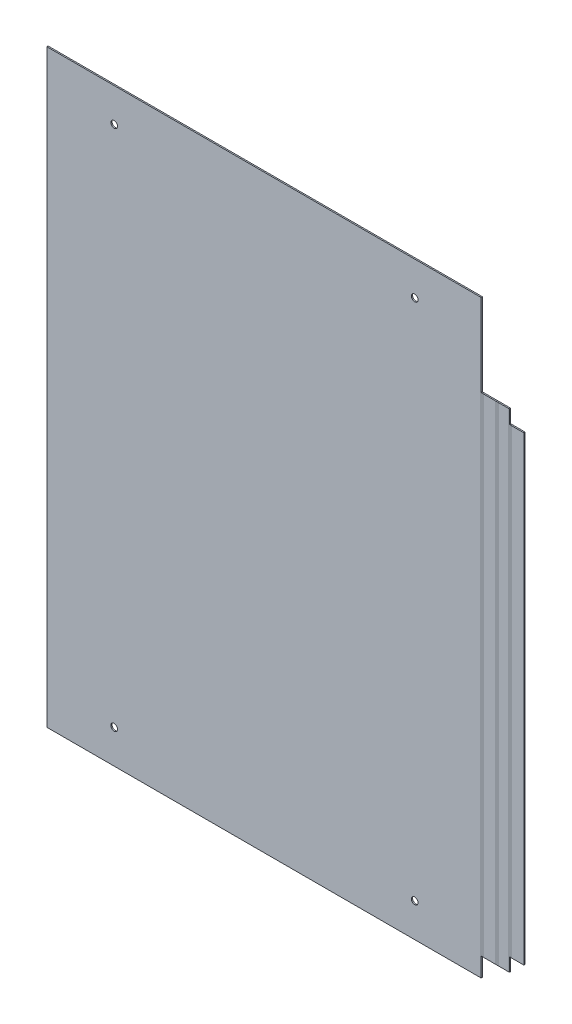
ISO-10303-21;
HEADER;
FILE_DESCRIPTION(('STEP AP214'),'2;1');
FILE_NAME('part.step','',(''),(''),'','','');
FILE_SCHEMA(('AUTOMOTIVE_DESIGN { 1 0 10303 214 1 1 1 1 }'));
ENDSEC;
DATA;
#1=APPLICATION_CONTEXT('core data for automotive mechanical design processes');
#2=APPLICATION_PROTOCOL_DEFINITION('international standard','automotive_design',2000,#1);
#3=PRODUCT_CONTEXT('',#1,'mechanical');
#4=PRODUCT('Part','Part','',(#3));
#5=PRODUCT_RELATED_PRODUCT_CATEGORY('part','',(#4));
#6=PRODUCT_DEFINITION_FORMATION('','',#4);
#7=PRODUCT_DEFINITION_CONTEXT('part definition',#1,'design');
#8=PRODUCT_DEFINITION('design','',#6,#7);
#9=PRODUCT_DEFINITION_SHAPE('','',#8);
#10=(LENGTH_UNIT() NAMED_UNIT(*) SI_UNIT(.MILLI.,.METRE.));
#11=(NAMED_UNIT(*) PLANE_ANGLE_UNIT() SI_UNIT($,.RADIAN.));
#12=(NAMED_UNIT(*) SI_UNIT($,.STERADIAN.) SOLID_ANGLE_UNIT());
#13=UNCERTAINTY_MEASURE_WITH_UNIT(LENGTH_MEASURE(1.E-05),#10,'distance_accuracy_value','');
#14=(GEOMETRIC_REPRESENTATION_CONTEXT(3) GLOBAL_UNCERTAINTY_ASSIGNED_CONTEXT((#13)) GLOBAL_UNIT_ASSIGNED_CONTEXT((#10,
#11,#12)) REPRESENTATION_CONTEXT('',''));
#15=CARTESIAN_POINT('',(0.,0.,0.));
#16=DIRECTION('',(0.,0.,1.));
#17=DIRECTION('',(1.,0.,0.));
#18=AXIS2_PLACEMENT_3D('',#15,#16,#17);
#19=CARTESIAN_POINT('',(343.802210169545,876.2,0.));
#20=DIRECTION('',(0.,0.,-1.));
#21=DIRECTION('',(-1.,0.,0.));
#22=AXIS2_PLACEMENT_3D('',#19,#20,#21);
#23=PLANE('',#22);
#24=DIRECTION('',(0.,-1.,0.));
#25=VECTOR('',#24,1.);
#26=CARTESIAN_POINT('',(346.438810169545,876.2,0.));
#27=LINE('',#26,#25);
#28=CARTESIAN_POINT('',(346.438810169545,753.7,0.));
#29=VERTEX_POINT('',#28);
#30=CARTESIAN_POINT('',(346.438810169545,28.4000000000006,0.));
#31=VERTEX_POINT('',#30);
#32=EDGE_CURVE('E430',#29,#31,#27,.T.);
#33=ORIENTED_EDGE('',*,*,#32,.F.);
#34=DIRECTION('',(-1.,0.,0.));
#35=VECTOR('',#34,1.);
#36=CARTESIAN_POINT('',(354.752210169545,753.7,0.));
#37=LINE('',#36,#35);
#38=CARTESIAN_POINT('',(363.065610169545,753.7,0.));
#39=VERTEX_POINT('',#38);
#40=EDGE_CURVE('E312',#39,#29,#37,.T.);
#41=ORIENTED_EDGE('',*,*,#40,.F.);
#42=DIRECTION('',(0.,-1.,0.));
#43=VECTOR('',#42,1.);
#44=CARTESIAN_POINT('',(363.065610169545,876.2,0.));
#45=LINE('',#44,#43);
#46=CARTESIAN_POINT('',(363.065610169545,28.4,0.));
#47=VERTEX_POINT('',#46);
#48=EDGE_CURVE('E440',#39,#47,#45,.T.);
#49=ORIENTED_EDGE('',*,*,#48,.T.);
#50=DIRECTION('',(-1.,0.,0.));
#51=VECTOR('',#50,1.);
#52=CARTESIAN_POINT('',(343.802210169545,28.4,0.));
#53=LINE('',#52,#51);
#54=EDGE_CURVE('E427',#47,#31,#53,.T.);
#55=ORIENTED_EDGE('',*,*,#54,.T.);
#56=EDGE_LOOP('',(#33,#41,#49,#55));
#57=FACE_BOUND('',#56,.T.);
#58=ADVANCED_FACE('F69',(#57),#23,.T.);
#59=CARTESIAN_POINT('',(343.802210169545,876.2,1.90000000000001));
#60=DIRECTION('',(0.,0.,-1.));
#61=DIRECTION('',(-1.,0.,0.));
#62=AXIS2_PLACEMENT_3D('',#59,#60,#61);
#63=PLANE('',#62);
#64=DIRECTION('',(-1.,0.,0.));
#65=VECTOR('',#64,1.);
#66=CARTESIAN_POINT('',(343.802210169545,753.7,1.90000000000001));
#67=LINE('',#66,#65);
#68=CARTESIAN_POINT('',(363.065610169545,753.7,1.90000000000001));
#69=VERTEX_POINT('',#68);
#70=CARTESIAN_POINT('',(346.438810169545,753.7,1.90000000000001));
#71=VERTEX_POINT('',#70);
#72=EDGE_CURVE('E91',#69,#71,#67,.T.);
#73=ORIENTED_EDGE('',*,*,#72,.T.);
#74=DIRECTION('',(0.,-1.,0.));
#75=VECTOR('',#74,1.);
#76=CARTESIAN_POINT('',(346.438810169545,876.2,1.90000000000001));
#77=LINE('',#76,#75);
#78=CARTESIAN_POINT('',(346.438810169545,28.4000000000004,1.90000000000001));
#79=VERTEX_POINT('',#78);
#80=EDGE_CURVE('E436',#71,#79,#77,.T.);
#81=ORIENTED_EDGE('',*,*,#80,.T.);
#82=DIRECTION('',(1.,0.,0.));
#83=VECTOR('',#82,1.);
#84=CARTESIAN_POINT('',(354.752210169545,28.4,1.90000000000001));
#85=LINE('',#84,#83);
#86=CARTESIAN_POINT('',(363.065610169545,28.4,1.90000000000001));
#87=VERTEX_POINT('',#86);
#88=EDGE_CURVE('E83',#87,#79,#85,.F.);
#89=ORIENTED_EDGE('',*,*,#88,.F.);
#90=DIRECTION('',(0.,-1.,0.));
#91=VECTOR('',#90,1.);
#92=CARTESIAN_POINT('',(363.065610169545,876.2,1.90000000000001));
#93=LINE('',#92,#91);
#94=EDGE_CURVE('E76',#69,#87,#93,.T.);
#95=ORIENTED_EDGE('',*,*,#94,.F.);
#96=EDGE_LOOP('',(#73,#81,#89,#95));
#97=FACE_BOUND('',#96,.T.);
#98=ADVANCED_FACE('F451',(#97),#63,.F.);
#99=CARTESIAN_POINT('',(343.802210169545,753.7,1.90000000000001));
#100=DIRECTION('',(0.,-1.,0.));
#101=DIRECTION('',(-1.,0.,0.));
#102=AXIS2_PLACEMENT_3D('',#99,#100,#101);
#103=PLANE('',#102);
#104=ORIENTED_EDGE('',*,*,#40,.T.);
#105=DIRECTION('',(0.,0.,1.));
#106=VECTOR('',#105,1.);
#107=CARTESIAN_POINT('',(346.438810169545,753.7,0.));
#108=LINE('',#107,#106);
#109=EDGE_CURVE('E438',#29,#71,#108,.T.);
#110=ORIENTED_EDGE('',*,*,#109,.T.);
#111=ORIENTED_EDGE('',*,*,#72,.F.);
#112=DIRECTION('',(0.,0.,1.));
#113=VECTOR('',#112,1.);
#114=CARTESIAN_POINT('',(363.065610169545,753.7,0.));
#115=LINE('',#114,#113);
#116=EDGE_CURVE('E442',#39,#69,#115,.T.);
#117=ORIENTED_EDGE('',*,*,#116,.F.);
#118=EDGE_LOOP('',(#104,#110,#111,#117));
#119=FACE_BOUND('',#118,.T.);
#120=ADVANCED_FACE('F456',(#119),#103,.F.);
#121=CARTESIAN_POINT('',(343.802210169545,28.4,0.));
#122=DIRECTION('',(0.,1.,0.));
#123=DIRECTION('',(-1.,0.,0.));
#124=AXIS2_PLACEMENT_3D('',#121,#122,#123);
#125=PLANE('',#124);
#126=DIRECTION('',(0.,0.,-1.));
#127=VECTOR('',#126,1.);
#128=CARTESIAN_POINT('',(363.065610169545,28.4000000000002,1.90000000000001));
#129=LINE('',#128,#127);
#130=EDGE_CURVE('E12',#87,#47,#129,.T.);
#131=ORIENTED_EDGE('',*,*,#130,.F.);
#132=ORIENTED_EDGE('',*,*,#88,.T.);
#133=DIRECTION('',(0.,-3.01445295852608E-13,-1.));
#134=VECTOR('',#133,1.);
#135=CARTESIAN_POINT('',(346.438810169545,28.4,1.90000000000007));
#136=LINE('',#135,#134);
#137=EDGE_CURVE('E434',#79,#31,#136,.T.);
#138=ORIENTED_EDGE('',*,*,#137,.T.);
#139=ORIENTED_EDGE('',*,*,#54,.F.);
#140=EDGE_LOOP('',(#131,#132,#138,#139));
#141=FACE_BOUND('',#140,.T.);
#142=ADVANCED_FACE('F531',(#141),#125,.F.);
#143=CARTESIAN_POINT('',(304.7866,876.2,25.7366));
#144=DIRECTION('',(0.,-1.,0.));
#145=DIRECTION('',(-1.,0.,0.));
#146=AXIS2_PLACEMENT_3D('',#143,#144,#145);
#147=PLANE('',#146);
#148=DIRECTION('',(1.,0.,0.));
#149=VECTOR('',#148,1.);
#150=CARTESIAN_POINT('',(-324.05,876.2,1.9));
#151=LINE('',#150,#149);
#152=CARTESIAN_POINT('',(-324.05,876.2,1.9));
#153=VERTEX_POINT('',#152);
#154=CARTESIAN_POINT('',(321.4134,876.2,1.9));
#155=VERTEX_POINT('',#154);
#156=EDGE_CURVE('E414',#153,#155,#151,.T.);
#157=ORIENTED_EDGE('',*,*,#156,.T.);
#158=DIRECTION('',(0.,0.,-1.));
#159=VECTOR('',#158,1.);
#160=CARTESIAN_POINT('',(321.4134,876.2,1.9));
#161=LINE('',#160,#159);
#162=CARTESIAN_POINT('',(321.4134,876.2,0.));
#163=VERTEX_POINT('',#162);
#164=EDGE_CURVE('E411',#155,#163,#161,.T.);
#165=ORIENTED_EDGE('',*,*,#164,.T.);
#166=DIRECTION('',(1.,0.,0.));
#167=VECTOR('',#166,1.);
#168=CARTESIAN_POINT('',(-324.05,876.2,0.));
#169=LINE('',#168,#167);
#170=CARTESIAN_POINT('',(-324.05,876.2,0.));
#171=VERTEX_POINT('',#170);
#172=EDGE_CURVE('E358',#171,#163,#169,.T.);
#173=ORIENTED_EDGE('',*,*,#172,.F.);
#174=DIRECTION('',(0.,0.,-1.));
#175=VECTOR('',#174,1.);
#176=CARTESIAN_POINT('',(-324.05,876.2,1.9));
#177=LINE('',#176,#175);
#178=EDGE_CURVE('E408',#153,#171,#177,.T.);
#179=ORIENTED_EDGE('',*,*,#178,.F.);
#180=EDGE_LOOP('',(#157,#165,#173,#179));
#181=FACE_BOUND('',#180,.T.);
#182=ADVANCED_FACE('F535',(#181),#147,.F.);
#183=CARTESIAN_POINT('',(-324.05,876.2,1.9));
#184=DIRECTION('',(-1.,0.,0.));
#185=DIRECTION('',(0.,0.,1.));
#186=AXIS2_PLACEMENT_3D('',#183,#184,#185);
#187=PLANE('',#186);
#188=DIRECTION('',(0.,0.,-1.));
#189=VECTOR('',#188,1.);
#190=CARTESIAN_POINT('',(-324.05,0.,1.9));
#191=LINE('',#190,#189);
#192=CARTESIAN_POINT('',(-324.05,0.,1.9));
#193=VERTEX_POINT('',#192);
#194=CARTESIAN_POINT('',(-324.05,0.,0.));
#195=VERTEX_POINT('',#194);
#196=EDGE_CURVE('E397',#193,#195,#191,.T.);
#197=ORIENTED_EDGE('',*,*,#196,.F.);
#198=DIRECTION('',(0.,-1.,0.));
#199=VECTOR('',#198,1.);
#200=CARTESIAN_POINT('',(-324.05,876.2,1.9));
#201=LINE('',#200,#199);
#202=EDGE_CURVE('E375',#153,#193,#201,.T.);
#203=ORIENTED_EDGE('',*,*,#202,.F.);
#204=ORIENTED_EDGE('',*,*,#178,.T.);
#205=DIRECTION('',(0.,-1.,0.));
#206=VECTOR('',#205,1.);
#207=CARTESIAN_POINT('',(-324.05,876.2,0.));
#208=LINE('',#207,#206);
#209=EDGE_CURVE('E406',#171,#195,#208,.T.);
#210=ORIENTED_EDGE('',*,*,#209,.T.);
#211=EDGE_LOOP('',(#197,#203,#204,#210));
#212=FACE_BOUND('',#211,.T.);
#213=ADVANCED_FACE('F941',(#212),#187,.T.);
#214=CARTESIAN_POINT('',(322.15,0.,2.6366));
#215=DIRECTION('',(0.,-1.,0.));
#216=DIRECTION('',(0.,0.,-1.));
#217=AXIS2_PLACEMENT_3D('',#214,#215,#216);
#218=PLANE('',#217);
#219=DIRECTION('',(1.,0.,0.));
#220=VECTOR('',#219,1.);
#221=CARTESIAN_POINT('',(-324.05,0.,0.));
#222=LINE('',#221,#220);
#223=CARTESIAN_POINT('',(321.4134,0.,0.));
#224=VERTEX_POINT('',#223);
#225=EDGE_CURVE('E403',#195,#224,#222,.T.);
#226=ORIENTED_EDGE('',*,*,#225,.T.);
#227=DIRECTION('',(0.,0.,1.));
#228=VECTOR('',#227,1.);
#229=CARTESIAN_POINT('',(321.4134,0.,0.));
#230=LINE('',#229,#228);
#231=CARTESIAN_POINT('',(321.4134,0.,1.9));
#232=VERTEX_POINT('',#231);
#233=EDGE_CURVE('E400',#224,#232,#230,.T.);
#234=ORIENTED_EDGE('',*,*,#233,.T.);
#235=DIRECTION('',(1.,0.,0.));
#236=VECTOR('',#235,1.);
#237=CARTESIAN_POINT('',(-324.05,0.,1.9));
#238=LINE('',#237,#236);
#239=EDGE_CURVE('E377',#193,#232,#238,.T.);
#240=ORIENTED_EDGE('',*,*,#239,.F.);
#241=ORIENTED_EDGE('',*,*,#196,.T.);
#242=EDGE_LOOP('',(#226,#234,#240,#241));
#243=FACE_BOUND('',#242,.T.);
#244=ADVANCED_FACE('F929',(#243),#218,.T.);
#245=CARTESIAN_POINT('',(-224.05,826.2,0.));
#246=DIRECTION('',(0.,0.,1.));
#247=DIRECTION('',(1.,0.,0.));
#248=AXIS2_PLACEMENT_3D('',#245,#246,#247);
#249=CYLINDRICAL_SURFACE('',#248,4.99999999999999);
#250=CARTESIAN_POINT('',(-224.05,826.2,0.));
#251=DIRECTION('',(0.,0.,1.));
#252=DIRECTION('',(1.,0.,0.));
#253=AXIS2_PLACEMENT_3D('',#250,#251,#252);
#254=CIRCLE('',#253,4.99999999999999);
#255=CARTESIAN_POINT('',(-219.05,826.2,0.));
#256=VERTEX_POINT('',#255);
#257=EDGE_CURVE('E361',#256,#256,#254,.T.);
#258=ORIENTED_EDGE('',*,*,#257,.F.);
#259=EDGE_LOOP('',(#258));
#260=FACE_BOUND('',#259,.T.);
#261=CARTESIAN_POINT('',(-224.05,826.2,1.9));
#262=DIRECTION('',(0.,0.,-1.));
#263=DIRECTION('',(-1.,0.,0.));
#264=AXIS2_PLACEMENT_3D('',#261,#262,#263);
#265=CIRCLE('',#264,4.99999999999999);
#266=CARTESIAN_POINT('',(-229.05,826.2,1.9));
#267=VERTEX_POINT('',#266);
#268=EDGE_CURVE('E380',#267,#267,#265,.T.);
#269=ORIENTED_EDGE('',*,*,#268,.F.);
#270=EDGE_LOOP('',(#269));
#271=FACE_BOUND('',#270,.T.);
#272=ADVANCED_FACE('F917',(#260,#271),#249,.F.);
#273=CARTESIAN_POINT('',(222.7317,826.2,0.));
#274=DIRECTION('',(0.,0.,1.));
#275=DIRECTION('',(1.,0.,0.));
#276=AXIS2_PLACEMENT_3D('',#273,#274,#275);
#277=CYLINDRICAL_SURFACE('',#276,5.00000000000002);
#278=CARTESIAN_POINT('',(222.7317,826.2,0.));
#279=DIRECTION('',(0.,0.,1.));
#280=DIRECTION('',(1.,0.,0.));
#281=AXIS2_PLACEMENT_3D('',#278,#279,#280);
#282=CIRCLE('',#281,5.00000000000002);
#283=CARTESIAN_POINT('',(227.7317,826.2,0.));
#284=VERTEX_POINT('',#283);
#285=EDGE_CURVE('E364',#284,#284,#282,.T.);
#286=ORIENTED_EDGE('',*,*,#285,.F.);
#287=EDGE_LOOP('',(#286));
#288=FACE_BOUND('',#287,.T.);
#289=CARTESIAN_POINT('',(222.7317,826.2,1.9));
#290=DIRECTION('',(0.,0.,-1.));
#291=DIRECTION('',(-1.,0.,0.));
#292=AXIS2_PLACEMENT_3D('',#289,#290,#291);
#293=CIRCLE('',#292,5.00000000000002);
#294=CARTESIAN_POINT('',(217.7317,826.2,1.9));
#295=VERTEX_POINT('',#294);
#296=EDGE_CURVE('E383',#295,#295,#293,.T.);
#297=ORIENTED_EDGE('',*,*,#296,.F.);
#298=EDGE_LOOP('',(#297));
#299=FACE_BOUND('',#298,.T.);
#300=ADVANCED_FACE('F905',(#288,#299),#277,.F.);
#301=CARTESIAN_POINT('',(222.7317,50.,0.));
#302=DIRECTION('',(0.,0.,1.));
#303=DIRECTION('',(1.,0.,0.));
#304=AXIS2_PLACEMENT_3D('',#301,#302,#303);
#305=CYLINDRICAL_SURFACE('',#304,5.00000000000002);
#306=CARTESIAN_POINT('',(222.7317,50.,0.));
#307=DIRECTION('',(0.,0.,1.));
#308=DIRECTION('',(-1.,0.,0.));
#309=AXIS2_PLACEMENT_3D('',#306,#307,#308);
#310=CIRCLE('',#309,5.00000000000002);
#311=CARTESIAN_POINT('',(217.7317,50.,0.));
#312=VERTEX_POINT('',#311);
#313=EDGE_CURVE('E367',#312,#312,#310,.T.);
#314=ORIENTED_EDGE('',*,*,#313,.F.);
#315=EDGE_LOOP('',(#314));
#316=FACE_BOUND('',#315,.T.);
#317=CARTESIAN_POINT('',(222.7317,50.,1.9));
#318=DIRECTION('',(0.,0.,-1.));
#319=DIRECTION('',(-1.,0.,0.));
#320=AXIS2_PLACEMENT_3D('',#317,#318,#319);
#321=CIRCLE('',#320,5.00000000000002);
#322=CARTESIAN_POINT('',(217.7317,50.,1.9));
#323=VERTEX_POINT('',#322);
#324=EDGE_CURVE('E386',#323,#323,#321,.T.);
#325=ORIENTED_EDGE('',*,*,#324,.F.);
#326=EDGE_LOOP('',(#325));
#327=FACE_BOUND('',#326,.T.);
#328=ADVANCED_FACE('F893',(#316,#327),#305,.F.);
#329=CARTESIAN_POINT('',(-224.05,50.,0.));
#330=DIRECTION('',(0.,0.,1.));
#331=DIRECTION('',(1.,0.,0.));
#332=AXIS2_PLACEMENT_3D('',#329,#330,#331);
#333=CYLINDRICAL_SURFACE('',#332,4.99999999999999);
#334=CARTESIAN_POINT('',(-224.05,50.,0.));
#335=DIRECTION('',(0.,0.,1.));
#336=DIRECTION('',(-1.,0.,0.));
#337=AXIS2_PLACEMENT_3D('',#334,#335,#336);
#338=CIRCLE('',#337,4.99999999999999);
#339=CARTESIAN_POINT('',(-229.05,50.,0.));
#340=VERTEX_POINT('',#339);
#341=EDGE_CURVE('E370',#340,#340,#338,.T.);
#342=ORIENTED_EDGE('',*,*,#341,.F.);
#343=EDGE_LOOP('',(#342));
#344=FACE_BOUND('',#343,.T.);
#345=CARTESIAN_POINT('',(-224.05,50.,1.9));
#346=DIRECTION('',(0.,0.,-1.));
#347=DIRECTION('',(-1.,0.,0.));
#348=AXIS2_PLACEMENT_3D('',#345,#346,#347);
#349=CIRCLE('',#348,4.99999999999999);
#350=CARTESIAN_POINT('',(-229.05,50.,1.9));
#351=VERTEX_POINT('',#350);
#352=EDGE_CURVE('E389',#351,#351,#349,.T.);
#353=ORIENTED_EDGE('',*,*,#352,.F.);
#354=EDGE_LOOP('',(#353));
#355=FACE_BOUND('',#354,.T.);
#356=ADVANCED_FACE('F881',(#344,#355),#333,.F.);
#357=CARTESIAN_POINT('',(321.4134,814.95,1.9));
#358=DIRECTION('',(1.,0.,0.));
#359=DIRECTION('',(0.,-1.,0.));
#360=AXIS2_PLACEMENT_3D('',#357,#358,#359);
#361=PLANE('',#360);
#362=ORIENTED_EDGE('',*,*,#164,.F.);
#363=DIRECTION('',(0.,-1.,0.));
#364=VECTOR('',#363,1.);
#365=CARTESIAN_POINT('',(321.4134,876.2,1.9));
#366=LINE('',#365,#364);
#367=CARTESIAN_POINT('',(321.4134,753.7,1.9));
#368=VERTEX_POINT('',#367);
#369=EDGE_CURVE('E395',#155,#368,#366,.T.);
#370=ORIENTED_EDGE('',*,*,#369,.T.);
#371=DIRECTION('',(0.,0.,-1.));
#372=VECTOR('',#371,1.);
#373=CARTESIAN_POINT('',(321.4134,753.7,1.9));
#374=LINE('',#373,#372);
#375=CARTESIAN_POINT('',(321.4134,753.7,0.));
#376=VERTEX_POINT('',#375);
#377=EDGE_CURVE('E392',#368,#376,#374,.T.);
#378=ORIENTED_EDGE('',*,*,#377,.T.);
#379=DIRECTION('',(0.,-1.,0.));
#380=VECTOR('',#379,1.);
#381=CARTESIAN_POINT('',(321.4134,876.2,0.));
#382=LINE('',#381,#380);
#383=EDGE_CURVE('E356',#163,#376,#382,.T.);
#384=ORIENTED_EDGE('',*,*,#383,.F.);
#385=EDGE_LOOP('',(#362,#370,#378,#384));
#386=FACE_BOUND('',#385,.T.);
#387=ADVANCED_FACE('F501',(#386),#361,.T.);
#388=CARTESIAN_POINT('',(-324.05,876.2,1.9));
#389=DIRECTION('',(0.,0.,-1.));
#390=DIRECTION('',(-1.,0.,0.));
#391=AXIS2_PLACEMENT_3D('',#388,#389,#390);
#392=PLANE('',#391);
#393=ORIENTED_EDGE('',*,*,#352,.T.);
#394=EDGE_LOOP('',(#393));
#395=FACE_BOUND('',#394,.T.);
#396=ORIENTED_EDGE('',*,*,#324,.T.);
#397=EDGE_LOOP('',(#396));
#398=FACE_BOUND('',#397,.T.);
#399=ORIENTED_EDGE('',*,*,#296,.T.);
#400=EDGE_LOOP('',(#399));
#401=FACE_BOUND('',#400,.T.);
#402=ORIENTED_EDGE('',*,*,#268,.T.);
#403=EDGE_LOOP('',(#402));
#404=FACE_BOUND('',#403,.T.);
#405=ORIENTED_EDGE('',*,*,#239,.T.);
#406=DIRECTION('',(0.,-1.,0.));
#407=VECTOR('',#406,1.);
#408=CARTESIAN_POINT('',(321.4134,876.2,1.9));
#409=LINE('',#408,#407);
#410=CARTESIAN_POINT('',(321.4134,28.4000000000006,1.9));
#411=VERTEX_POINT('',#410);
#412=EDGE_CURVE('E373',#411,#232,#409,.T.);
#413=ORIENTED_EDGE('',*,*,#412,.F.);
#414=DIRECTION('',(0.,-1.,0.));
#415=VECTOR('',#414,1.);
#416=CARTESIAN_POINT('',(321.4134,876.2,1.9));
#417=LINE('',#416,#415);
#418=EDGE_CURVE('E345',#368,#411,#417,.T.);
#419=ORIENTED_EDGE('',*,*,#418,.F.);
#420=ORIENTED_EDGE('',*,*,#369,.F.);
#421=ORIENTED_EDGE('',*,*,#156,.F.);
#422=ORIENTED_EDGE('',*,*,#202,.T.);
#423=EDGE_LOOP('',(#405,#413,#419,#420,#421,#422));
#424=FACE_BOUND('',#423,.T.);
#425=ADVANCED_FACE('F858',(#395,#398,#401,#404,#424),#392,.F.);
#426=CARTESIAN_POINT('',(321.4134,14.2000000000002,1.9));
#427=DIRECTION('',(1.,0.,0.));
#428=DIRECTION('',(0.,-1.,0.));
#429=AXIS2_PLACEMENT_3D('',#426,#427,#428);
#430=PLANE('',#429);
#431=ORIENTED_EDGE('',*,*,#412,.T.);
#432=ORIENTED_EDGE('',*,*,#233,.F.);
#433=DIRECTION('',(0.,-1.,0.));
#434=VECTOR('',#433,1.);
#435=CARTESIAN_POINT('',(321.4134,876.2,0.));
#436=LINE('',#435,#434);
#437=CARTESIAN_POINT('',(321.4134,28.4000000000011,0.));
#438=VERTEX_POINT('',#437);
#439=EDGE_CURVE('E351',#438,#224,#436,.T.);
#440=ORIENTED_EDGE('',*,*,#439,.F.);
#441=DIRECTION('',(0.,-3.01445295852608E-13,-1.));
#442=VECTOR('',#441,1.);
#443=CARTESIAN_POINT('',(321.4134,28.4,1.9));
#444=LINE('',#443,#442);
#445=EDGE_CURVE('E339',#411,#438,#444,.T.);
#446=ORIENTED_EDGE('',*,*,#445,.F.);
#447=EDGE_LOOP('',(#431,#432,#440,#446));
#448=FACE_BOUND('',#447,.T.);
#449=ADVANCED_FACE('F513',(#448),#430,.T.);
#450=CARTESIAN_POINT('',(-324.05,876.2,0.));
#451=DIRECTION('',(0.,0.,-1.));
#452=DIRECTION('',(-1.,0.,0.));
#453=AXIS2_PLACEMENT_3D('',#450,#451,#452);
#454=PLANE('',#453);
#455=ORIENTED_EDGE('',*,*,#341,.T.);
#456=EDGE_LOOP('',(#455));
#457=FACE_BOUND('',#456,.T.);
#458=ORIENTED_EDGE('',*,*,#313,.T.);
#459=EDGE_LOOP('',(#458));
#460=FACE_BOUND('',#459,.T.);
#461=ORIENTED_EDGE('',*,*,#285,.T.);
#462=EDGE_LOOP('',(#461));
#463=FACE_BOUND('',#462,.T.);
#464=ORIENTED_EDGE('',*,*,#257,.T.);
#465=EDGE_LOOP('',(#464));
#466=FACE_BOUND('',#465,.T.);
#467=ORIENTED_EDGE('',*,*,#225,.F.);
#468=ORIENTED_EDGE('',*,*,#209,.F.);
#469=ORIENTED_EDGE('',*,*,#172,.T.);
#470=ORIENTED_EDGE('',*,*,#383,.T.);
#471=DIRECTION('',(0.,-1.,0.));
#472=VECTOR('',#471,1.);
#473=CARTESIAN_POINT('',(321.4134,876.2,0.));
#474=LINE('',#473,#472);
#475=EDGE_CURVE('E354',#376,#438,#474,.T.);
#476=ORIENTED_EDGE('',*,*,#475,.T.);
#477=ORIENTED_EDGE('',*,*,#439,.T.);
#478=EDGE_LOOP('',(#467,#468,#469,#470,#476,#477));
#479=FACE_BOUND('',#478,.T.);
#480=ADVANCED_FACE('F510',(#457,#460,#463,#466,#479),#454,.T.);
#481=CARTESIAN_POINT('',(321.4134,753.7,0.));
#482=DIRECTION('',(0.,1.,0.));
#483=DIRECTION('',(1.,0.,0.));
#484=AXIS2_PLACEMENT_3D('',#481,#482,#483);
#485=PLANE('',#484);
#486=ORIENTED_EDGE('',*,*,#377,.F.);
#487=DIRECTION('',(-1.,0.,0.));
#488=VECTOR('',#487,1.);
#489=CARTESIAN_POINT('',(322.738052542386,753.7,1.9));
#490=LINE('',#489,#488);
#491=CARTESIAN_POINT('',(324.062705084772,753.7,1.90000000000001));
#492=VERTEX_POINT('',#491);
#493=EDGE_CURVE('E348',#368,#492,#490,.F.);
#494=ORIENTED_EDGE('',*,*,#493,.T.);
#495=DIRECTION('',(0.,0.,1.));
#496=VECTOR('',#495,1.);
#497=CARTESIAN_POINT('',(324.062705084772,753.7,0.));
#498=LINE('',#497,#496);
#499=CARTESIAN_POINT('',(324.062705084772,753.7,0.));
#500=VERTEX_POINT('',#499);
#501=EDGE_CURVE('E309',#500,#492,#498,.T.);
#502=ORIENTED_EDGE('',*,*,#501,.F.);
#503=DIRECTION('',(1.,0.,0.));
#504=VECTOR('',#503,1.);
#505=CARTESIAN_POINT('',(321.4134,753.7,0.));
#506=LINE('',#505,#504);
#507=EDGE_CURVE('E327',#376,#500,#506,.T.);
#508=ORIENTED_EDGE('',*,*,#507,.F.);
#509=EDGE_LOOP('',(#486,#494,#502,#508));
#510=FACE_BOUND('',#509,.T.);
#511=ADVANCED_FACE('F498',(#510),#485,.T.);
#512=CARTESIAN_POINT('',(322.738052542386,391.05,1.9));
#513=DIRECTION('',(0.,0.,-1.));
#514=DIRECTION('',(-1.,0.,0.));
#515=AXIS2_PLACEMENT_3D('',#512,#513,#514);
#516=PLANE('',#515);
#517=DIRECTION('',(0.,-1.,0.));
#518=VECTOR('',#517,1.);
#519=CARTESIAN_POINT('',(324.062705084772,876.2,1.90000000000001));
#520=LINE('',#519,#518);
#521=CARTESIAN_POINT('',(324.062705084772,28.4,1.90000000000001));
#522=VERTEX_POINT('',#521);
#523=EDGE_CURVE('E315',#492,#522,#520,.T.);
#524=ORIENTED_EDGE('',*,*,#523,.F.);
#525=ORIENTED_EDGE('',*,*,#493,.F.);
#526=ORIENTED_EDGE('',*,*,#418,.T.);
#527=DIRECTION('',(-1.,0.,0.));
#528=VECTOR('',#527,1.);
#529=CARTESIAN_POINT('',(322.738052542386,28.4,1.9));
#530=LINE('',#529,#528);
#531=EDGE_CURVE('E342',#522,#411,#530,.T.);
#532=ORIENTED_EDGE('',*,*,#531,.F.);
#533=EDGE_LOOP('',(#524,#525,#526,#532));
#534=FACE_BOUND('',#533,.T.);
#535=ADVANCED_FACE('F496',(#534),#516,.F.);
#536=CARTESIAN_POINT('',(324.062705084772,28.4,0.));
#537=DIRECTION('',(-2.51437185775208E-13,-1.,0.));
#538=DIRECTION('',(-1.,2.51437185775208E-13,0.));
#539=AXIS2_PLACEMENT_3D('',#536,#537,#538);
#540=PLANE('',#539);
#541=ORIENTED_EDGE('',*,*,#531,.T.);
#542=ORIENTED_EDGE('',*,*,#445,.T.);
#543=DIRECTION('',(-1.,2.51437185775208E-13,0.));
#544=VECTOR('',#543,1.);
#545=CARTESIAN_POINT('',(324.062705084772,28.4,0.));
#546=LINE('',#545,#544);
#547=CARTESIAN_POINT('',(324.062705084772,28.4,0.));
#548=VERTEX_POINT('',#547);
#549=EDGE_CURVE('E330',#548,#438,#546,.T.);
#550=ORIENTED_EDGE('',*,*,#549,.F.);
#551=DIRECTION('',(0.,0.,1.));
#552=VECTOR('',#551,1.);
#553=CARTESIAN_POINT('',(324.062705084772,28.4,0.));
#554=LINE('',#553,#552);
#555=EDGE_CURVE('E336',#548,#522,#554,.T.);
#556=ORIENTED_EDGE('',*,*,#555,.T.);
#557=EDGE_LOOP('',(#541,#542,#550,#556));
#558=FACE_BOUND('',#557,.T.);
#559=ADVANCED_FACE('F515',(#558),#540,.T.);
#560=CARTESIAN_POINT('',(322.738052542386,391.05,0.));
#561=DIRECTION('',(0.,0.,-1.));
#562=DIRECTION('',(-1.,0.,0.));
#563=AXIS2_PLACEMENT_3D('',#560,#561,#562);
#564=PLANE('',#563);
#565=DIRECTION('',(0.,-1.,0.));
#566=VECTOR('',#565,1.);
#567=CARTESIAN_POINT('',(324.062705084772,876.2,0.));
#568=LINE('',#567,#566);
#569=EDGE_CURVE('E333',#500,#548,#568,.T.);
#570=ORIENTED_EDGE('',*,*,#569,.T.);
#571=ORIENTED_EDGE('',*,*,#549,.T.);
#572=ORIENTED_EDGE('',*,*,#475,.F.);
#573=ORIENTED_EDGE('',*,*,#507,.T.);
#574=EDGE_LOOP('',(#570,#571,#572,#573));
#575=FACE_BOUND('',#574,.T.);
#576=ADVANCED_FACE('F505',(#575),#564,.T.);
#577=CARTESIAN_POINT('',(321.426105084772,876.2,0.));
#578=DIRECTION('',(0.,0.,-1.));
#579=DIRECTION('',(-1.,0.,0.));
#580=AXIS2_PLACEMENT_3D('',#577,#578,#579);
#581=PLANE('',#580);
#582=ORIENTED_EDGE('',*,*,#569,.F.);
#583=DIRECTION('',(-1.,0.,0.));
#584=VECTOR('',#583,1.);
#585=CARTESIAN_POINT('',(333.926105084772,753.7,0.));
#586=LINE('',#585,#584);
#587=CARTESIAN_POINT('',(343.789505084772,753.7,0.));
#588=VERTEX_POINT('',#587);
#589=EDGE_CURVE('E313',#588,#500,#586,.T.);
#590=ORIENTED_EDGE('',*,*,#589,.F.);
#591=DIRECTION('',(0.,-1.,0.));
#592=VECTOR('',#591,1.);
#593=CARTESIAN_POINT('',(343.789505084772,876.2,0.));
#594=LINE('',#593,#592);
#595=CARTESIAN_POINT('',(343.789505084772,28.4000000000009,0.));
#596=VERTEX_POINT('',#595);
#597=EDGE_CURVE('E325',#588,#596,#594,.T.);
#598=ORIENTED_EDGE('',*,*,#597,.T.);
#599=DIRECTION('',(-1.,0.,0.));
#600=VECTOR('',#599,1.);
#601=CARTESIAN_POINT('',(321.426105084772,28.4,0.));
#602=LINE('',#601,#600);
#603=EDGE_CURVE('E322',#596,#548,#602,.T.);
#604=ORIENTED_EDGE('',*,*,#603,.T.);
#605=EDGE_LOOP('',(#582,#590,#598,#604));
#606=FACE_BOUND('',#605,.T.);
#607=ADVANCED_FACE('F473',(#606),#581,.T.);
#608=CARTESIAN_POINT('',(321.426105084772,28.4,0.));
#609=DIRECTION('',(0.,1.,0.));
#610=DIRECTION('',(-1.,0.,0.));
#611=AXIS2_PLACEMENT_3D('',#608,#609,#610);
#612=PLANE('',#611);
#613=DIRECTION('',(0.,-3.01445295852618E-13,-1.));
#614=VECTOR('',#613,1.);
#615=CARTESIAN_POINT('',(343.789505084772,28.4,1.90000000000001));
#616=LINE('',#615,#614);
#617=CARTESIAN_POINT('',(343.789505084772,28.4000000000004,1.90000000000001));
#618=VERTEX_POINT('',#617);
#619=EDGE_CURVE('E417',#618,#596,#616,.T.);
#620=ORIENTED_EDGE('',*,*,#619,.F.);
#621=DIRECTION('',(1.,0.,0.));
#622=VECTOR('',#621,1.);
#623=CARTESIAN_POINT('',(333.926105084772,28.4,1.90000000000001));
#624=LINE('',#623,#622);
#625=EDGE_CURVE('E320',#618,#522,#624,.F.);
#626=ORIENTED_EDGE('',*,*,#625,.T.);
#627=ORIENTED_EDGE('',*,*,#555,.F.);
#628=ORIENTED_EDGE('',*,*,#603,.F.);
#629=EDGE_LOOP('',(#620,#626,#627,#628));
#630=FACE_BOUND('',#629,.T.);
#631=ADVANCED_FACE('F477',(#630),#612,.F.);
#632=CARTESIAN_POINT('',(321.426105084772,876.2,1.90000000000001));
#633=DIRECTION('',(0.,0.,-1.));
#634=DIRECTION('',(-1.,0.,0.));
#635=AXIS2_PLACEMENT_3D('',#632,#633,#634);
#636=PLANE('',#635);
#637=DIRECTION('',(-1.,0.,0.));
#638=VECTOR('',#637,1.);
#639=CARTESIAN_POINT('',(323.326105084772,753.7,1.90000000000001));
#640=LINE('',#639,#638);
#641=CARTESIAN_POINT('',(343.789505084772,753.7,1.90000000000001));
#642=VERTEX_POINT('',#641);
#643=EDGE_CURVE('E318',#642,#492,#640,.T.);
#644=ORIENTED_EDGE('',*,*,#643,.T.);
#645=ORIENTED_EDGE('',*,*,#523,.T.);
#646=ORIENTED_EDGE('',*,*,#625,.F.);
#647=DIRECTION('',(0.,-1.,0.));
#648=VECTOR('',#647,1.);
#649=CARTESIAN_POINT('',(343.789505084772,876.2,1.90000000000001));
#650=LINE('',#649,#648);
#651=EDGE_CURVE('E420',#642,#618,#650,.T.);
#652=ORIENTED_EDGE('',*,*,#651,.F.);
#653=EDGE_LOOP('',(#644,#645,#646,#652));
#654=FACE_BOUND('',#653,.T.);
#655=ADVANCED_FACE('F486',(#654),#636,.F.);
#656=CARTESIAN_POINT('',(323.326105084772,753.7,1.90000000000001));
#657=DIRECTION('',(0.,-1.,0.));
#658=DIRECTION('',(-1.,0.,0.));
#659=AXIS2_PLACEMENT_3D('',#656,#657,#658);
#660=PLANE('',#659);
#661=ORIENTED_EDGE('',*,*,#589,.T.);
#662=ORIENTED_EDGE('',*,*,#501,.T.);
#663=ORIENTED_EDGE('',*,*,#643,.F.);
#664=DIRECTION('',(0.,0.,1.));
#665=VECTOR('',#664,1.);
#666=CARTESIAN_POINT('',(343.789505084772,753.7,0.));
#667=LINE('',#666,#665);
#668=EDGE_CURVE('E304',#588,#642,#667,.T.);
#669=ORIENTED_EDGE('',*,*,#668,.F.);
#670=EDGE_LOOP('',(#661,#662,#663,#669));
#671=FACE_BOUND('',#670,.T.);
#672=ADVANCED_FACE('F488',(#671),#660,.F.);
#673=CARTESIAN_POINT('',(343.789505084772,753.7,0.));
#674=DIRECTION('',(0.,1.,0.));
#675=DIRECTION('',(1.,0.,0.));
#676=AXIS2_PLACEMENT_3D('',#673,#674,#675);
#677=PLANE('',#676);
#678=ORIENTED_EDGE('',*,*,#668,.T.);
#679=DIRECTION('',(-1.,0.,0.));
#680=VECTOR('',#679,1.);
#681=CARTESIAN_POINT('',(345.114157627158,753.7,1.9));
#682=LINE('',#681,#680);
#683=EDGE_CURVE('E296',#642,#71,#682,.F.);
#684=ORIENTED_EDGE('',*,*,#683,.T.);
#685=ORIENTED_EDGE('',*,*,#109,.F.);
#686=DIRECTION('',(1.,0.,0.));
#687=VECTOR('',#686,1.);
#688=CARTESIAN_POINT('',(343.789505084772,753.7,0.));
#689=LINE('',#688,#687);
#690=EDGE_CURVE('E297',#588,#29,#689,.T.);
#691=ORIENTED_EDGE('',*,*,#690,.F.);
#692=EDGE_LOOP('',(#678,#684,#685,#691));
#693=FACE_BOUND('',#692,.T.);
#694=ADVANCED_FACE('F466',(#693),#677,.T.);
#695=CARTESIAN_POINT('',(346.438810169545,28.4000000000004,0.));
#696=DIRECTION('',(0.,-1.,0.));
#697=DIRECTION('',(-1.,0.,0.));
#698=AXIS2_PLACEMENT_3D('',#695,#696,#697);
#699=PLANE('',#698);
#700=DIRECTION('',(-1.,0.,0.));
#701=VECTOR('',#700,1.);
#702=CARTESIAN_POINT('',(345.114157627158,28.4000000000006,1.9));
#703=LINE('',#702,#701);
#704=EDGE_CURVE('E301',#79,#618,#703,.T.);
#705=ORIENTED_EDGE('',*,*,#704,.T.);
#706=ORIENTED_EDGE('',*,*,#619,.T.);
#707=DIRECTION('',(-1.,0.,0.));
#708=VECTOR('',#707,1.);
#709=CARTESIAN_POINT('',(346.438810169545,28.4000000000004,0.));
#710=LINE('',#709,#708);
#711=EDGE_CURVE('E300',#31,#596,#710,.T.);
#712=ORIENTED_EDGE('',*,*,#711,.F.);
#713=ORIENTED_EDGE('',*,*,#137,.F.);
#714=EDGE_LOOP('',(#705,#706,#712,#713));
#715=FACE_BOUND('',#714,.T.);
#716=ADVANCED_FACE('F479',(#715),#699,.T.);
#717=CARTESIAN_POINT('',(345.114157627158,391.05,0.));
#718=DIRECTION('',(0.,0.,-1.));
#719=DIRECTION('',(-1.,0.,0.));
#720=AXIS2_PLACEMENT_3D('',#717,#718,#719);
#721=PLANE('',#720);
#722=ORIENTED_EDGE('',*,*,#32,.T.);
#723=ORIENTED_EDGE('',*,*,#711,.T.);
#724=ORIENTED_EDGE('',*,*,#597,.F.);
#725=ORIENTED_EDGE('',*,*,#690,.T.);
#726=EDGE_LOOP('',(#722,#723,#724,#725));
#727=FACE_BOUND('',#726,.T.);
#728=ADVANCED_FACE('F469',(#727),#721,.T.);
#729=CARTESIAN_POINT('',(345.114157627158,391.05,1.9));
#730=DIRECTION('',(0.,0.,-1.));
#731=DIRECTION('',(-1.,0.,0.));
#732=AXIS2_PLACEMENT_3D('',#729,#730,#731);
#733=PLANE('',#732);
#734=ORIENTED_EDGE('',*,*,#80,.F.);
#735=ORIENTED_EDGE('',*,*,#683,.F.);
#736=ORIENTED_EDGE('',*,*,#651,.T.);
#737=ORIENTED_EDGE('',*,*,#704,.F.);
#738=EDGE_LOOP('',(#734,#735,#736,#737));
#739=FACE_BOUND('',#738,.T.);
#740=ADVANCED_FACE('F483',(#739),#733,.F.);
#741=CARTESIAN_POINT('',(363.065610169545,753.7,0.));
#742=DIRECTION('',(0.,1.,0.));
#743=DIRECTION('',(1.,0.,0.));
#744=AXIS2_PLACEMENT_3D('',#741,#742,#743);
#745=PLANE('',#744);
#746=ORIENTED_EDGE('',*,*,#116,.T.);
#747=DIRECTION('',(-1.,0.,0.));
#748=VECTOR('',#747,1.);
#749=CARTESIAN_POINT('',(364.390262711931,753.7,1.9));
#750=LINE('',#749,#748);
#751=CARTESIAN_POINT('',(363.543159288139,753.7,1.9));
#752=VERTEX_POINT('',#751);
#753=EDGE_CURVE('E286',#69,#752,#750,.F.);
#754=ORIENTED_EDGE('',*,*,#753,.T.);
#755=DIRECTION('',(0.,0.,-1.));
#756=VECTOR('',#755,1.);
#757=CARTESIAN_POINT('',(363.543159288139,753.7,0.));
#758=LINE('',#757,#756);
#759=CARTESIAN_POINT('',(363.543159288139,753.7,0.));
#760=VERTEX_POINT('',#759);
#761=EDGE_CURVE('E294',#752,#760,#758,.T.);
#762=ORIENTED_EDGE('',*,*,#761,.T.);
#763=DIRECTION('',(1.,0.,0.));
#764=VECTOR('',#763,1.);
#765=CARTESIAN_POINT('',(363.065610169545,753.7,0.));
#766=LINE('',#765,#764);
#767=EDGE_CURVE('E252',#39,#760,#766,.T.);
#768=ORIENTED_EDGE('',*,*,#767,.F.);
#769=EDGE_LOOP('',(#746,#754,#762,#768));
#770=FACE_BOUND('',#769,.T.);
#771=ADVANCED_FACE('F454',(#770),#745,.T.);
#772=CARTESIAN_POINT('',(363.543159288139,733.7,0.));
#773=DIRECTION('',(1.,0.,0.));
#774=DIRECTION('',(0.,-1.,0.));
#775=AXIS2_PLACEMENT_3D('',#772,#773,#774);
#776=PLANE('',#775);
#777=ORIENTED_EDGE('',*,*,#761,.F.);
#778=DIRECTION('',(0.,1.,0.));
#779=VECTOR('',#778,1.);
#780=CARTESIAN_POINT('',(363.543159288139,391.05,1.9));
#781=LINE('',#780,#779);
#782=CARTESIAN_POINT('',(363.543159288139,733.7,1.9));
#783=VERTEX_POINT('',#782);
#784=EDGE_CURVE('E283',#752,#783,#781,.F.);
#785=ORIENTED_EDGE('',*,*,#784,.T.);
#786=DIRECTION('',(0.,0.,-1.));
#787=VECTOR('',#786,1.);
#788=CARTESIAN_POINT('',(363.543159288139,733.7,0.));
#789=LINE('',#788,#787);
#790=CARTESIAN_POINT('',(363.543159288139,733.7,0.));
#791=VERTEX_POINT('',#790);
#792=EDGE_CURVE('E292',#783,#791,#789,.T.);
#793=ORIENTED_EDGE('',*,*,#792,.T.);
#794=DIRECTION('',(0.,-1.,0.));
#795=VECTOR('',#794,1.);
#796=CARTESIAN_POINT('',(363.543159288139,733.7,0.));
#797=LINE('',#796,#795);
#798=EDGE_CURVE('E255',#760,#791,#797,.T.);
#799=ORIENTED_EDGE('',*,*,#798,.F.);
#800=EDGE_LOOP('',(#777,#785,#793,#799));
#801=FACE_BOUND('',#800,.T.);
#802=ADVANCED_FACE('F595',(#801),#776,.T.);
#803=CARTESIAN_POINT('',(363.543159288139,733.7,0.));
#804=DIRECTION('',(0.,1.,0.));
#805=DIRECTION('',(1.,0.,0.));
#806=AXIS2_PLACEMENT_3D('',#803,#804,#805);
#807=PLANE('',#806);
#808=ORIENTED_EDGE('',*,*,#792,.F.);
#809=DIRECTION('',(-1.,0.,0.));
#810=VECTOR('',#809,1.);
#811=CARTESIAN_POINT('',(364.390262711931,733.7,1.9));
#812=LINE('',#811,#810);
#813=CARTESIAN_POINT('',(365.714915254317,733.7,1.90000000000001));
#814=VERTEX_POINT('',#813);
#815=EDGE_CURVE('E280',#783,#814,#812,.F.);
#816=ORIENTED_EDGE('',*,*,#815,.T.);
#817=DIRECTION('',(0.,0.,-1.));
#818=VECTOR('',#817,1.);
#819=CARTESIAN_POINT('',(365.714915254317,733.7,1.90000000000001));
#820=LINE('',#819,#818);
#821=CARTESIAN_POINT('',(365.714915254317,733.7,0.));
#822=VERTEX_POINT('',#821);
#823=EDGE_CURVE('E247',#814,#822,#820,.T.);
#824=ORIENTED_EDGE('',*,*,#823,.T.);
#825=DIRECTION('',(1.,0.,0.));
#826=VECTOR('',#825,1.);
#827=CARTESIAN_POINT('',(363.543159288139,733.7,0.));
#828=LINE('',#827,#826);
#829=EDGE_CURVE('E259',#791,#822,#828,.T.);
#830=ORIENTED_EDGE('',*,*,#829,.F.);
#831=EDGE_LOOP('',(#808,#816,#824,#830));
#832=FACE_BOUND('',#831,.T.);
#833=ADVANCED_FACE('F601',(#832),#807,.T.);
#834=CARTESIAN_POINT('',(365.714915254317,48.4000000000002,0.));
#835=DIRECTION('',(0.,-1.,0.));
#836=DIRECTION('',(-1.,0.,0.));
#837=AXIS2_PLACEMENT_3D('',#834,#835,#836);
#838=PLANE('',#837);
#839=DIRECTION('',(0.,0.,-1.));
#840=VECTOR('',#839,1.);
#841=CARTESIAN_POINT('',(365.714915254317,48.4,1.90000000000001));
#842=LINE('',#841,#840);
#843=CARTESIAN_POINT('',(365.714915254317,48.4,1.90000000000001));
#844=VERTEX_POINT('',#843);
#845=CARTESIAN_POINT('',(365.714915254317,48.4000000000002,0.));
#846=VERTEX_POINT('',#845);
#847=EDGE_CURVE('E223',#844,#846,#842,.T.);
#848=ORIENTED_EDGE('',*,*,#847,.F.);
#849=DIRECTION('',(-1.,0.,0.));
#850=VECTOR('',#849,1.);
#851=CARTESIAN_POINT('',(364.390262711931,48.4000000000002,1.9));
#852=LINE('',#851,#850);
#853=CARTESIAN_POINT('',(363.543159288139,48.4000000000002,1.9));
#854=VERTEX_POINT('',#853);
#855=EDGE_CURVE('E277',#844,#854,#852,.T.);
#856=ORIENTED_EDGE('',*,*,#855,.T.);
#857=DIRECTION('',(0.,0.,-1.));
#858=VECTOR('',#857,1.);
#859=CARTESIAN_POINT('',(363.543159288139,48.4000000000002,0.));
#860=LINE('',#859,#858);
#861=CARTESIAN_POINT('',(363.543159288139,48.4000000000002,0.));
#862=VERTEX_POINT('',#861);
#863=EDGE_CURVE('E290',#854,#862,#860,.T.);
#864=ORIENTED_EDGE('',*,*,#863,.T.);
#865=DIRECTION('',(-1.,0.,0.));
#866=VECTOR('',#865,1.);
#867=CARTESIAN_POINT('',(365.714915254317,48.4000000000002,0.));
#868=LINE('',#867,#866);
#869=EDGE_CURVE('E262',#846,#862,#868,.T.);
#870=ORIENTED_EDGE('',*,*,#869,.F.);
#871=EDGE_LOOP('',(#848,#856,#864,#870));
#872=FACE_BOUND('',#871,.T.);
#873=ADVANCED_FACE('F609',(#872),#838,.T.);
#874=CARTESIAN_POINT('',(363.543159288139,28.4000000000002,0.));
#875=DIRECTION('',(1.,0.,0.));
#876=DIRECTION('',(0.,-1.,0.));
#877=AXIS2_PLACEMENT_3D('',#874,#875,#876);
#878=PLANE('',#877);
#879=ORIENTED_EDGE('',*,*,#863,.F.);
#880=DIRECTION('',(0.,1.,0.));
#881=VECTOR('',#880,1.);
#882=CARTESIAN_POINT('',(363.543159288139,391.05,1.9));
#883=LINE('',#882,#881);
#884=CARTESIAN_POINT('',(363.543159288139,28.4000000000002,1.9));
#885=VERTEX_POINT('',#884);
#886=EDGE_CURVE('E274',#854,#885,#883,.F.);
#887=ORIENTED_EDGE('',*,*,#886,.T.);
#888=DIRECTION('',(0.,0.,-1.));
#889=VECTOR('',#888,1.);
#890=CARTESIAN_POINT('',(363.543159288139,28.4000000000002,0.));
#891=LINE('',#890,#889);
#892=CARTESIAN_POINT('',(363.543159288139,28.4000000000002,0.));
#893=VERTEX_POINT('',#892);
#894=EDGE_CURVE('E271',#885,#893,#891,.T.);
#895=ORIENTED_EDGE('',*,*,#894,.T.);
#896=DIRECTION('',(0.,-1.,0.));
#897=VECTOR('',#896,1.);
#898=CARTESIAN_POINT('',(363.543159288139,28.4000000000002,0.));
#899=LINE('',#898,#897);
#900=EDGE_CURVE('E265',#862,#893,#899,.T.);
#901=ORIENTED_EDGE('',*,*,#900,.F.);
#902=EDGE_LOOP('',(#879,#887,#895,#901));
#903=FACE_BOUND('',#902,.T.);
#904=ADVANCED_FACE('F617',(#903),#878,.T.);
#905=CARTESIAN_POINT('',(363.065610169545,28.4,0.));
#906=DIRECTION('',(4.64967050046609E-13,-1.,0.));
#907=DIRECTION('',(-1.,-4.64967050046609E-13,0.));
#908=AXIS2_PLACEMENT_3D('',#905,#906,#907);
#909=PLANE('',#908);
#910=ORIENTED_EDGE('',*,*,#894,.F.);
#911=DIRECTION('',(-1.,0.,0.));
#912=VECTOR('',#911,1.);
#913=CARTESIAN_POINT('',(364.390262711931,28.4000000000002,1.9));
#914=LINE('',#913,#912);
#915=EDGE_CURVE('E256',#885,#87,#914,.T.);
#916=ORIENTED_EDGE('',*,*,#915,.T.);
#917=ORIENTED_EDGE('',*,*,#130,.T.);
#918=DIRECTION('',(-1.,-4.64967050046609E-13,0.));
#919=VECTOR('',#918,1.);
#920=CARTESIAN_POINT('',(363.065610169545,28.4,0.));
#921=LINE('',#920,#919);
#922=EDGE_CURVE('E268',#893,#47,#921,.T.);
#923=ORIENTED_EDGE('',*,*,#922,.F.);
#924=EDGE_LOOP('',(#910,#916,#917,#923));
#925=FACE_BOUND('',#924,.T.);
#926=ADVANCED_FACE('F625',(#925),#909,.T.);
#927=CARTESIAN_POINT('',(364.390262711931,391.05,0.));
#928=DIRECTION('',(0.,0.,-1.));
#929=DIRECTION('',(-1.,0.,0.));
#930=AXIS2_PLACEMENT_3D('',#927,#928,#929);
#931=PLANE('',#930);
#932=ORIENTED_EDGE('',*,*,#922,.T.);
#933=ORIENTED_EDGE('',*,*,#48,.F.);
#934=ORIENTED_EDGE('',*,*,#767,.T.);
#935=ORIENTED_EDGE('',*,*,#798,.T.);
#936=ORIENTED_EDGE('',*,*,#829,.T.);
#937=DIRECTION('',(0.,-1.,0.));
#938=VECTOR('',#937,1.);
#939=CARTESIAN_POINT('',(365.714915254317,876.2,0.));
#940=LINE('',#939,#938);
#941=EDGE_CURVE('E250',#822,#846,#940,.T.);
#942=ORIENTED_EDGE('',*,*,#941,.T.);
#943=ORIENTED_EDGE('',*,*,#869,.T.);
#944=ORIENTED_EDGE('',*,*,#900,.T.);
#945=EDGE_LOOP('',(#932,#933,#934,#935,#936,#942,#943,#944));
#946=FACE_BOUND('',#945,.T.);
#947=ADVANCED_FACE('F634',(#946),#931,.T.);
#948=CARTESIAN_POINT('',(364.390262711931,391.05,1.9));
#949=DIRECTION('',(0.,0.,-1.));
#950=DIRECTION('',(-1.,0.,0.));
#951=AXIS2_PLACEMENT_3D('',#948,#949,#950);
#952=PLANE('',#951);
#953=ORIENTED_EDGE('',*,*,#915,.F.);
#954=ORIENTED_EDGE('',*,*,#886,.F.);
#955=ORIENTED_EDGE('',*,*,#855,.F.);
#956=DIRECTION('',(0.,-1.,0.));
#957=VECTOR('',#956,1.);
#958=CARTESIAN_POINT('',(365.714915254317,876.2,1.90000000000001));
#959=LINE('',#958,#957);
#960=EDGE_CURVE('E1097',#814,#844,#959,.T.);
#961=ORIENTED_EDGE('',*,*,#960,.F.);
#962=ORIENTED_EDGE('',*,*,#815,.F.);
#963=ORIENTED_EDGE('',*,*,#784,.F.);
#964=ORIENTED_EDGE('',*,*,#753,.F.);
#965=ORIENTED_EDGE('',*,*,#94,.T.);
#966=EDGE_LOOP('',(#953,#954,#955,#961,#962,#963,#964,#965));
#967=FACE_BOUND('',#966,.T.);
#968=ADVANCED_FACE('F448',(#967),#952,.F.);
#969=CARTESIAN_POINT('',(384.978315254317,876.2,0.));
#970=DIRECTION('',(1.,0.,0.));
#971=DIRECTION('',(0.,0.,-1.));
#972=AXIS2_PLACEMENT_3D('',#969,#970,#971);
#973=PLANE('',#972);
#974=DIRECTION('',(0.,-1.,0.));
#975=VECTOR('',#974,1.);
#976=CARTESIAN_POINT('',(384.978315254317,876.2,0.));
#977=LINE('',#976,#975);
#978=CARTESIAN_POINT('',(384.978315254317,733.7,0.));
#979=VERTEX_POINT('',#978);
#980=CARTESIAN_POINT('',(384.978315254317,48.4,0.));
#981=VERTEX_POINT('',#980);
#982=EDGE_CURVE('E229',#979,#981,#977,.T.);
#983=ORIENTED_EDGE('',*,*,#982,.F.);
#984=DIRECTION('',(0.,0.,-1.));
#985=VECTOR('',#984,1.);
#986=CARTESIAN_POINT('',(384.978315254317,733.7,1.90000000000001));
#987=LINE('',#986,#985);
#988=CARTESIAN_POINT('',(384.978315254317,733.7,1.90000000000001));
#989=VERTEX_POINT('',#988);
#990=EDGE_CURVE('E245',#979,#989,#987,.F.);
#991=ORIENTED_EDGE('',*,*,#990,.T.);
#992=DIRECTION('',(0.,-1.,0.));
#993=VECTOR('',#992,1.);
#994=CARTESIAN_POINT('',(384.978315254317,876.2,1.90000000000001));
#995=LINE('',#994,#993);
#996=CARTESIAN_POINT('',(384.978315254317,48.4,1.90000000000001));
#997=VERTEX_POINT('',#996);
#998=EDGE_CURVE('E237',#989,#997,#995,.T.);
#999=ORIENTED_EDGE('',*,*,#998,.T.);
#1000=DIRECTION('',(0.,0.,1.));
#1001=VECTOR('',#1000,1.);
#1002=CARTESIAN_POINT('',(384.978315254317,48.4,0.));
#1003=LINE('',#1002,#1001);
#1004=EDGE_CURVE('E220',#997,#981,#1003,.F.);
#1005=ORIENTED_EDGE('',*,*,#1004,.T.);
#1006=EDGE_LOOP('',(#983,#991,#999,#1005));
#1007=FACE_BOUND('',#1006,.T.);
#1008=ADVANCED_FACE('F234',(#1007),#973,.T.);
#1009=CARTESIAN_POINT('',(364.978315254317,876.2,0.));
#1010=DIRECTION('',(0.,0.,-1.));
#1011=DIRECTION('',(-1.,0.,0.));
#1012=AXIS2_PLACEMENT_3D('',#1009,#1010,#1011);
#1013=PLANE('',#1012);
#1014=ORIENTED_EDGE('',*,*,#941,.F.);
#1015=DIRECTION('',(-1.,0.,0.));
#1016=VECTOR('',#1015,1.);
#1017=CARTESIAN_POINT('',(375.346615254317,733.7,0.));
#1018=LINE('',#1017,#1016);
#1019=EDGE_CURVE('E228',#979,#822,#1018,.T.);
#1020=ORIENTED_EDGE('',*,*,#1019,.F.);
#1021=ORIENTED_EDGE('',*,*,#982,.T.);
#1022=DIRECTION('',(-1.,0.,0.));
#1023=VECTOR('',#1022,1.);
#1024=CARTESIAN_POINT('',(364.978315254317,48.4,0.));
#1025=LINE('',#1024,#1023);
#1026=EDGE_CURVE('E217',#981,#846,#1025,.T.);
#1027=ORIENTED_EDGE('',*,*,#1026,.T.);
#1028=EDGE_LOOP('',(#1014,#1020,#1021,#1027));
#1029=FACE_BOUND('',#1028,.T.);
#1030=ADVANCED_FACE('F240',(#1029),#1013,.T.);
#1031=CARTESIAN_POINT('',(362.341715254317,733.7,1.90000000000001));
#1032=DIRECTION('',(0.,-1.,0.));
#1033=DIRECTION('',(-1.,0.,0.));
#1034=AXIS2_PLACEMENT_3D('',#1031,#1032,#1033);
#1035=PLANE('',#1034);
#1036=ORIENTED_EDGE('',*,*,#990,.F.);
#1037=ORIENTED_EDGE('',*,*,#1019,.T.);
#1038=ORIENTED_EDGE('',*,*,#823,.F.);
#1039=DIRECTION('',(-1.,0.,0.));
#1040=VECTOR('',#1039,1.);
#1041=CARTESIAN_POINT('',(362.341715254317,733.7,1.90000000000001));
#1042=LINE('',#1041,#1040);
#1043=EDGE_CURVE('E1094',#989,#814,#1042,.T.);
#1044=ORIENTED_EDGE('',*,*,#1043,.F.);
#1045=EDGE_LOOP('',(#1036,#1037,#1038,#1044));
#1046=FACE_BOUND('',#1045,.T.);
#1047=ADVANCED_FACE('F660',(#1046),#1035,.F.);
#1048=CARTESIAN_POINT('',(364.978315254317,876.2,1.90000000000001));
#1049=DIRECTION('',(0.,0.,-1.));
#1050=DIRECTION('',(-1.,0.,0.));
#1051=AXIS2_PLACEMENT_3D('',#1048,#1049,#1050);
#1052=PLANE('',#1051);
#1053=ORIENTED_EDGE('',*,*,#1043,.T.);
#1054=ORIENTED_EDGE('',*,*,#960,.T.);
#1055=DIRECTION('',(1.,0.,0.));
#1056=VECTOR('',#1055,1.);
#1057=CARTESIAN_POINT('',(375.346615254317,48.4,1.90000000000001));
#1058=LINE('',#1057,#1056);
#1059=EDGE_CURVE('E1102',#997,#844,#1058,.F.);
#1060=ORIENTED_EDGE('',*,*,#1059,.F.);
#1061=ORIENTED_EDGE('',*,*,#998,.F.);
#1062=EDGE_LOOP('',(#1053,#1054,#1060,#1061));
#1063=FACE_BOUND('',#1062,.T.);
#1064=ADVANCED_FACE('F667',(#1063),#1052,.F.);
#1065=CARTESIAN_POINT('',(364.978315254317,48.4,0.));
#1066=DIRECTION('',(0.,1.,0.));
#1067=DIRECTION('',(-1.,0.,0.));
#1068=AXIS2_PLACEMENT_3D('',#1065,#1066,#1067);
#1069=PLANE('',#1068);
#1070=ORIENTED_EDGE('',*,*,#1004,.F.);
#1071=ORIENTED_EDGE('',*,*,#1059,.T.);
#1072=ORIENTED_EDGE('',*,*,#847,.T.);
#1073=ORIENTED_EDGE('',*,*,#1026,.F.);
#1074=EDGE_LOOP('',(#1070,#1071,#1072,#1073));
#1075=FACE_BOUND('',#1074,.T.);
#1076=ADVANCED_FACE('F219',(#1075),#1069,.F.);
#1077=CLOSED_SHELL('',(#58,#98,#120,#142,#182,#213,#244,#272,#300,#328,#356,#387,#425,#449,#480,
#511,#535,#559,#576,#607,#631,#655,#672,#694,#716,#728,#740,#771,#802,#833,#873,#904,#926,#947,
#968,#1008,#1030,#1047,#1064,#1076));
#1078=MANIFOLD_SOLID_BREP('B2',#1077);
#1079=ADVANCED_BREP_SHAPE_REPRESENTATION('',(#18,#1078),#14);
#1080=SHAPE_DEFINITION_REPRESENTATION(#9,#1079);
ENDSEC;
END-ISO-10303-21;
